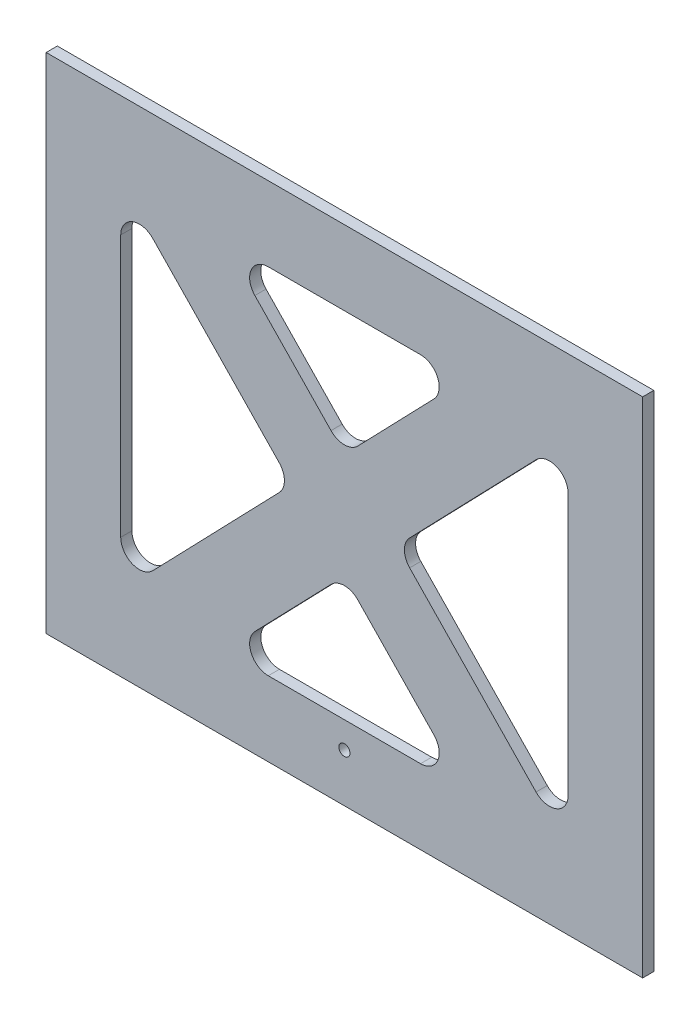
ISO-10303-21;
HEADER;
FILE_DESCRIPTION(('STEP AP214'),'2;1');
FILE_NAME('part.step','',(''),(''),'','','');
FILE_SCHEMA(('AUTOMOTIVE_DESIGN { 1 0 10303 214 1 1 1 1 }'));
ENDSEC;
DATA;
#1=APPLICATION_CONTEXT('core data for automotive mechanical design processes');
#2=APPLICATION_PROTOCOL_DEFINITION('international standard','automotive_design',2000,#1);
#3=PRODUCT_CONTEXT('',#1,'mechanical');
#4=PRODUCT('Part','Part','',(#3));
#5=PRODUCT_RELATED_PRODUCT_CATEGORY('part','',(#4));
#6=PRODUCT_DEFINITION_FORMATION('','',#4);
#7=PRODUCT_DEFINITION_CONTEXT('part definition',#1,'design');
#8=PRODUCT_DEFINITION('design','',#6,#7);
#9=PRODUCT_DEFINITION_SHAPE('','',#8);
#10=(LENGTH_UNIT() NAMED_UNIT(*) SI_UNIT(.MILLI.,.METRE.));
#11=(NAMED_UNIT(*) PLANE_ANGLE_UNIT() SI_UNIT($,.RADIAN.));
#12=(NAMED_UNIT(*) SI_UNIT($,.STERADIAN.) SOLID_ANGLE_UNIT());
#13=UNCERTAINTY_MEASURE_WITH_UNIT(LENGTH_MEASURE(1.E-05),#10,'distance_accuracy_value','');
#14=(GEOMETRIC_REPRESENTATION_CONTEXT(3) GLOBAL_UNCERTAINTY_ASSIGNED_CONTEXT((#13)) GLOBAL_UNIT_ASSIGNED_CONTEXT((#10,
#11,#12)) REPRESENTATION_CONTEXT('',''));
#15=CARTESIAN_POINT('',(0.,0.,0.));
#16=DIRECTION('',(0.,0.,1.));
#17=DIRECTION('',(1.,0.,0.));
#18=AXIS2_PLACEMENT_3D('',#15,#16,#17);
#19=CARTESIAN_POINT('',(0.,0.,154.999999999998));
#20=DIRECTION('',(0.,0.,1.));
#21=DIRECTION('',(1.,0.,0.));
#22=AXIS2_PLACEMENT_3D('',#19,#20,#21);
#23=PLANE('',#22);
#24=CARTESIAN_POINT('',(-1.74582570622306E-11,-41.6319362166387,154.999999999998));
#25=DIRECTION('',(0.,0.,1.));
#26=DIRECTION('',(1.,0.,0.));
#27=AXIS2_PLACEMENT_3D('',#24,#25,#26);
#28=CIRCLE('',#27,1.5);
#29=CARTESIAN_POINT('',(1.49999999998254,-41.6319362166387,154.999999999998));
#30=VERTEX_POINT('',#29);
#31=EDGE_CURVE('E597',#30,#30,#28,.T.);
#32=ORIENTED_EDGE('',*,*,#31,.F.);
#33=EDGE_LOOP('',(#32));
#34=FACE_BOUND('',#33,.T.);
#35=DIRECTION('',(0.,-1.,0.));
#36=VECTOR('',#35,1.);
#37=CARTESIAN_POINT('',(-80.0000000000175,80.4171451103803,154.999999999998));
#38=LINE('',#37,#36);
#39=CARTESIAN_POINT('',(-80.0000000000175,80.4171451103803,154.999999999998));
#40=VERTEX_POINT('',#39);
#41=CARTESIAN_POINT('',(-80.0000000000175,-54.5828548896206,154.999999999998));
#42=VERTEX_POINT('',#41);
#43=EDGE_CURVE('E411',#40,#42,#38,.T.);
#44=ORIENTED_EDGE('',*,*,#43,.T.);
#45=DIRECTION('',(1.,0.,0.));
#46=VECTOR('',#45,1.);
#47=CARTESIAN_POINT('',(-80.0000000000175,-54.5828548896206,154.999999999998));
#48=LINE('',#47,#46);
#49=CARTESIAN_POINT('',(79.9999999999825,-54.5828548896206,154.999999999998));
#50=VERTEX_POINT('',#49);
#51=EDGE_CURVE('E414',#42,#50,#48,.T.);
#52=ORIENTED_EDGE('',*,*,#51,.T.);
#53=DIRECTION('',(0.,1.,0.));
#54=VECTOR('',#53,1.);
#55=CARTESIAN_POINT('',(79.9999999999825,80.4171451103803,154.999999999998));
#56=LINE('',#55,#54);
#57=CARTESIAN_POINT('',(79.9999999999825,80.4171451103803,154.999999999998));
#58=VERTEX_POINT('',#57);
#59=EDGE_CURVE('E417',#50,#58,#56,.T.);
#60=ORIENTED_EDGE('',*,*,#59,.T.);
#61=DIRECTION('',(-1.,0.,0.));
#62=VECTOR('',#61,1.);
#63=CARTESIAN_POINT('',(-80.0000000000175,80.4171451103803,154.999999999998));
#64=LINE('',#63,#62);
#65=EDGE_CURVE('E419',#58,#40,#64,.T.);
#66=ORIENTED_EDGE('',*,*,#65,.T.);
#67=EDGE_LOOP('',(#44,#52,#60,#66));
#68=FACE_BOUND('',#67,.T.);
#69=DIRECTION('',(0.694544358283579,0.719449883158272,0.));
#70=VECTOR('',#69,1.);
#71=CARTESIAN_POINT('',(-17.4968341698801,9.44442331896196,154.999999999998));
#72=LINE('',#71,#70);
#73=CARTESIAN_POINT('',(-51.4027505842312,-25.6773184556925,154.999999999998));
#74=VERTEX_POINT('',#73);
#75=CARTESIAN_POINT('',(-17.4968341698801,9.44442331896196,154.999999999998));
#76=VERTEX_POINT('',#75);
#77=EDGE_CURVE('E368',#74,#76,#72,.T.);
#78=ORIENTED_EDGE('',*,*,#77,.F.);
#79=CARTESIAN_POINT('',(-55.0000000000225,-22.2045966642746,154.999999999998));
#80=DIRECTION('',(0.,0.,1.));
#81=DIRECTION('',(-1.,0.,0.));
#82=AXIS2_PLACEMENT_3D('',#79,#80,#81);
#83=CIRCLE('',#82,4.99999999999999);
#84=CARTESIAN_POINT('',(-60.0000000000225,-22.2045966642746,154.999999999998));
#85=VERTEX_POINT('',#84);
#86=EDGE_CURVE('E366',#85,#74,#83,.T.);
#87=ORIENTED_EDGE('',*,*,#86,.F.);
#88=DIRECTION('',(0.,-1.,0.));
#89=VECTOR('',#88,1.);
#90=CARTESIAN_POINT('',(-60.0000000000225,-22.2045966642746,154.999999999998));
#91=LINE('',#90,#89);
#92=CARTESIAN_POINT('',(-60.0000000000225,48.0388868850344,154.999999999998));
#93=VERTEX_POINT('',#92);
#94=EDGE_CURVE('E378',#93,#85,#91,.T.);
#95=ORIENTED_EDGE('',*,*,#94,.F.);
#96=CARTESIAN_POINT('',(-55.0000000000225,48.0388868850344,154.999999999998));
#97=DIRECTION('',(0.,0.,1.));
#98=DIRECTION('',(1.,0.,0.));
#99=AXIS2_PLACEMENT_3D('',#96,#97,#98);
#100=CIRCLE('',#99,4.99999999999999);
#101=CARTESIAN_POINT('',(-51.4027505842312,51.5116086764523,154.999999999998));
#102=VERTEX_POINT('',#101);
#103=EDGE_CURVE('E375',#102,#93,#100,.T.);
#104=ORIENTED_EDGE('',*,*,#103,.F.);
#105=DIRECTION('',(-0.694544358283579,0.719449883158272,0.));
#106=VECTOR('',#105,1.);
#107=CARTESIAN_POINT('',(-51.4027505842312,51.5116086764523,154.999999999998));
#108=LINE('',#107,#106);
#109=CARTESIAN_POINT('',(-17.4968341698801,16.3898669017978,154.999999999998));
#110=VERTEX_POINT('',#109);
#111=EDGE_CURVE('E373',#110,#102,#108,.T.);
#112=ORIENTED_EDGE('',*,*,#111,.F.);
#113=CARTESIAN_POINT('',(-21.0940835856715,12.9171451103799,154.999999999998));
#114=DIRECTION('',(0.,0.,1.));
#115=DIRECTION('',(1.,0.,0.));
#116=AXIS2_PLACEMENT_3D('',#113,#114,#115);
#117=CIRCLE('',#116,5.);
#118=EDGE_CURVE('E371',#76,#110,#117,.T.);
#119=ORIENTED_EDGE('',*,*,#118,.F.);
#120=EDGE_LOOP('',(#78,#87,#95,#104,#112,#119));
#121=FACE_BOUND('',#120,.T.);
#122=DIRECTION('',(-0.694544358283579,0.719449883158272,0.));
#123=VECTOR('',#122,1.);
#124=CARTESIAN_POINT('',(3.59724941577325,-4.95342651376468,154.999999999998));
#125=LINE('',#124,#123);
#126=CARTESIAN_POINT('',(24.0215646350307,-26.1101330982027,154.999999999998));
#127=VERTEX_POINT('',#126);
#128=CARTESIAN_POINT('',(3.59724941577325,-4.95342651376468,154.999999999998));
#129=VERTEX_POINT('',#128);
#130=EDGE_CURVE('E323',#127,#129,#125,.T.);
#131=ORIENTED_EDGE('',*,*,#130,.F.);
#132=CARTESIAN_POINT('',(20.4243152192394,-29.5828548896206,154.999999999998));
#133=DIRECTION('',(0.,0.,1.));
#134=DIRECTION('',(-1.,0.,0.));
#135=AXIS2_PLACEMENT_3D('',#132,#133,#134);
#136=CIRCLE('',#135,5.);
#137=CARTESIAN_POINT('',(20.4243152192394,-34.5828548896206,154.999999999998));
#138=VERTEX_POINT('',#137);
#139=EDGE_CURVE('E321',#138,#127,#136,.T.);
#140=ORIENTED_EDGE('',*,*,#139,.F.);
#141=DIRECTION('',(1.,0.,0.));
#142=VECTOR('',#141,1.);
#143=CARTESIAN_POINT('',(20.4243152192394,-34.5828548896206,154.999999999998));
#144=LINE('',#143,#142);
#145=CARTESIAN_POINT('',(-20.4243152192756,-34.5828548896206,154.999999999998));
#146=VERTEX_POINT('',#145);
#147=EDGE_CURVE('E333',#146,#138,#144,.T.);
#148=ORIENTED_EDGE('',*,*,#147,.F.);
#149=CARTESIAN_POINT('',(-20.4243152192756,-29.5828548896206,154.999999999998));
#150=DIRECTION('',(0.,0.,1.));
#151=DIRECTION('',(1.,0.,0.));
#152=AXIS2_PLACEMENT_3D('',#149,#150,#151);
#153=CIRCLE('',#152,5.);
#154=CARTESIAN_POINT('',(-24.0215646350669,-26.1101330982027,154.999999999998));
#155=VERTEX_POINT('',#154);
#156=EDGE_CURVE('E330',#155,#146,#153,.T.);
#157=ORIENTED_EDGE('',*,*,#156,.F.);
#158=DIRECTION('',(-0.694544358283579,-0.719449883158272,0.));
#159=VECTOR('',#158,1.);
#160=CARTESIAN_POINT('',(-24.0215646350669,-26.1101330982027,154.999999999998));
#161=LINE('',#160,#159);
#162=CARTESIAN_POINT('',(-3.59724941580946,-4.95342651376468,154.999999999998));
#163=VERTEX_POINT('',#162);
#164=EDGE_CURVE('E328',#163,#155,#161,.T.);
#165=ORIENTED_EDGE('',*,*,#164,.F.);
#166=CARTESIAN_POINT('',(-1.81005299471863E-11,-8.42614830518258,154.999999999998));
#167=DIRECTION('',(0.,0.,1.));
#168=DIRECTION('',(-1.,0.,0.));
#169=AXIS2_PLACEMENT_3D('',#166,#167,#168);
#170=CIRCLE('',#169,5.);
#171=EDGE_CURVE('E326',#129,#163,#170,.T.);
#172=ORIENTED_EDGE('',*,*,#171,.F.);
#173=EDGE_LOOP('',(#131,#140,#148,#157,#165,#172));
#174=FACE_BOUND('',#173,.T.);
#175=DIRECTION('',(0.69454435828358,-0.719449883158272,0.));
#176=VECTOR('',#175,1.);
#177=CARTESIAN_POINT('',(17.4968341698452,9.44442331896196,154.999999999998));
#178=LINE('',#177,#176);
#179=CARTESIAN_POINT('',(17.4968341698452,9.44442331896196,154.999999999998));
#180=VERTEX_POINT('',#179);
#181=CARTESIAN_POINT('',(51.4027505841949,-25.6773184556912,154.999999999998));
#182=VERTEX_POINT('',#181);
#183=EDGE_CURVE('E278',#180,#182,#178,.T.);
#184=ORIENTED_EDGE('',*,*,#183,.F.);
#185=CARTESIAN_POINT('',(21.0940835856365,12.9171451103799,154.999999999998));
#186=DIRECTION('',(0.,0.,1.));
#187=DIRECTION('',(1.,0.,0.));
#188=AXIS2_PLACEMENT_3D('',#185,#186,#187);
#189=CIRCLE('',#188,5.);
#190=CARTESIAN_POINT('',(17.4968341698452,16.3898669017977,154.999999999998));
#191=VERTEX_POINT('',#190);
#192=EDGE_CURVE('E276',#191,#180,#189,.T.);
#193=ORIENTED_EDGE('',*,*,#192,.F.);
#194=DIRECTION('',(-0.694544358283579,-0.719449883158272,0.));
#195=VECTOR('',#194,1.);
#196=CARTESIAN_POINT('',(51.402750584195,51.5116086764509,154.999999999998));
#197=LINE('',#196,#195);
#198=CARTESIAN_POINT('',(51.402750584195,51.5116086764509,154.999999999998));
#199=VERTEX_POINT('',#198);
#200=EDGE_CURVE('E288',#199,#191,#197,.T.);
#201=ORIENTED_EDGE('',*,*,#200,.F.);
#202=CARTESIAN_POINT('',(54.9999999999863,48.038886885033,154.999999999998));
#203=DIRECTION('',(0.,0.,1.));
#204=DIRECTION('',(1.,0.,0.));
#205=AXIS2_PLACEMENT_3D('',#202,#203,#204);
#206=CIRCLE('',#205,5.);
#207=CARTESIAN_POINT('',(59.9999999999863,48.038886885033,154.999999999998));
#208=VERTEX_POINT('',#207);
#209=EDGE_CURVE('E285',#208,#199,#206,.T.);
#210=ORIENTED_EDGE('',*,*,#209,.F.);
#211=DIRECTION('',(0.,1.,0.));
#212=VECTOR('',#211,1.);
#213=CARTESIAN_POINT('',(59.9999999999863,-22.2045966642733,154.999999999998));
#214=LINE('',#213,#212);
#215=CARTESIAN_POINT('',(59.9999999999863,-22.2045966642733,154.999999999998));
#216=VERTEX_POINT('',#215);
#217=EDGE_CURVE('E283',#216,#208,#214,.T.);
#218=ORIENTED_EDGE('',*,*,#217,.F.);
#219=CARTESIAN_POINT('',(54.9999999999863,-22.2045966642733,154.999999999998));
#220=DIRECTION('',(0.,0.,1.));
#221=DIRECTION('',(1.,0.,0.));
#222=AXIS2_PLACEMENT_3D('',#219,#220,#221);
#223=CIRCLE('',#222,5.00000000000001);
#224=EDGE_CURVE('E281',#182,#216,#223,.T.);
#225=ORIENTED_EDGE('',*,*,#224,.F.);
#226=EDGE_LOOP('',(#184,#193,#201,#210,#218,#225));
#227=FACE_BOUND('',#226,.T.);
#228=DIRECTION('',(0.694544358283579,-0.719449883158272,0.));
#229=VECTOR('',#228,1.);
#230=CARTESIAN_POINT('',(-24.0215646350669,51.9444233189624,154.999999999998));
#231=LINE('',#230,#229);
#232=CARTESIAN_POINT('',(-24.0215646350669,51.9444233189624,154.999999999998));
#233=VERTEX_POINT('',#232);
#234=CARTESIAN_POINT('',(-3.59724941580946,30.7877167345244,154.999999999998));
#235=VERTEX_POINT('',#234);
#236=EDGE_CURVE('E232',#233,#235,#231,.T.);
#237=ORIENTED_EDGE('',*,*,#236,.F.);
#238=CARTESIAN_POINT('',(-20.4243152192756,55.4171451103803,154.999999999998));
#239=DIRECTION('',(0.,0.,1.));
#240=DIRECTION('',(-1.,0.,0.));
#241=AXIS2_PLACEMENT_3D('',#238,#239,#240);
#242=CIRCLE('',#241,5.);
#243=CARTESIAN_POINT('',(-20.4243152192756,60.4171451103803,154.999999999998));
#244=VERTEX_POINT('',#243);
#245=EDGE_CURVE('E224',#244,#233,#242,.T.);
#246=ORIENTED_EDGE('',*,*,#245,.F.);
#247=DIRECTION('',(-1.,0.,0.));
#248=VECTOR('',#247,1.);
#249=CARTESIAN_POINT('',(20.4243152192394,60.4171451103803,154.999999999998));
#250=LINE('',#249,#248);
#251=CARTESIAN_POINT('',(20.4243152192394,60.4171451103803,154.999999999998));
#252=VERTEX_POINT('',#251);
#253=EDGE_CURVE('E254',#252,#244,#250,.T.);
#254=ORIENTED_EDGE('',*,*,#253,.F.);
#255=CARTESIAN_POINT('',(20.4243152192394,55.4171451103803,154.999999999998));
#256=DIRECTION('',(0.,0.,1.));
#257=DIRECTION('',(1.,0.,0.));
#258=AXIS2_PLACEMENT_3D('',#255,#256,#257);
#259=CIRCLE('',#258,5.);
#260=CARTESIAN_POINT('',(24.0215646350307,51.9444233189624,154.999999999998));
#261=VERTEX_POINT('',#260);
#262=EDGE_CURVE('E252',#261,#252,#259,.T.);
#263=ORIENTED_EDGE('',*,*,#262,.F.);
#264=DIRECTION('',(0.69454435828358,0.719449883158272,0.));
#265=VECTOR('',#264,1.);
#266=CARTESIAN_POINT('',(3.59724941577325,30.7877167345244,154.999999999998));
#267=LINE('',#266,#265);
#268=CARTESIAN_POINT('',(3.59724941577326,30.7877167345244,154.999999999998));
#269=VERTEX_POINT('',#268);
#270=EDGE_CURVE('E247',#269,#261,#267,.T.);
#271=ORIENTED_EDGE('',*,*,#270,.F.);
#272=CARTESIAN_POINT('',(-1.81005299471863E-11,34.2604385259423,154.999999999998));
#273=DIRECTION('',(0.,0.,1.));
#274=DIRECTION('',(-1.,0.,0.));
#275=AXIS2_PLACEMENT_3D('',#272,#273,#274);
#276=CIRCLE('',#275,5.);
#277=EDGE_CURVE('E245',#235,#269,#276,.T.);
#278=ORIENTED_EDGE('',*,*,#277,.F.);
#279=EDGE_LOOP('',(#237,#246,#254,#263,#271,#278));
#280=FACE_BOUND('',#279,.T.);
#281=ADVANCED_FACE('F38',(#34,#68,#121,#174,#227,#280),#23,.T.);
#282=CARTESIAN_POINT('',(0.,0.,151.999999999998));
#283=DIRECTION('',(0.,0.,1.));
#284=DIRECTION('',(1.,0.,0.));
#285=AXIS2_PLACEMENT_3D('',#282,#283,#284);
#286=PLANE('',#285);
#287=CARTESIAN_POINT('',(-1.74582570622306E-11,-41.6319362166387,151.999999999998));
#288=DIRECTION('',(0.,0.,1.));
#289=DIRECTION('',(1.,0.,0.));
#290=AXIS2_PLACEMENT_3D('',#287,#288,#289);
#291=CIRCLE('',#290,1.5);
#292=CARTESIAN_POINT('',(1.49999999998254,-41.6319362166387,151.999999999998));
#293=VERTEX_POINT('',#292);
#294=EDGE_CURVE('E42',#293,#293,#291,.T.);
#295=ORIENTED_EDGE('',*,*,#294,.T.);
#296=EDGE_LOOP('',(#295));
#297=FACE_BOUND('',#296,.T.);
#298=CARTESIAN_POINT('',(21.0940835856365,12.9171451103799,151.999999999998));
#299=DIRECTION('',(0.,0.,1.));
#300=DIRECTION('',(1.,0.,0.));
#301=AXIS2_PLACEMENT_3D('',#298,#299,#300);
#302=CIRCLE('',#301,5.);
#303=CARTESIAN_POINT('',(17.4968341698452,16.3898669017977,151.999999999998));
#304=VERTEX_POINT('',#303);
#305=CARTESIAN_POINT('',(17.4968341698452,9.44442331896196,151.999999999998));
#306=VERTEX_POINT('',#305);
#307=EDGE_CURVE('E240',#304,#306,#302,.T.);
#308=ORIENTED_EDGE('',*,*,#307,.T.);
#309=DIRECTION('',(0.69454435828358,-0.719449883158272,0.));
#310=VECTOR('',#309,1.);
#311=CARTESIAN_POINT('',(17.4968341698452,9.44442331896196,151.999999999998));
#312=LINE('',#311,#310);
#313=CARTESIAN_POINT('',(51.4027505841949,-25.6773184556912,151.999999999998));
#314=VERTEX_POINT('',#313);
#315=EDGE_CURVE('E293',#306,#314,#312,.T.);
#316=ORIENTED_EDGE('',*,*,#315,.T.);
#317=CARTESIAN_POINT('',(54.9999999999863,-22.2045966642733,151.999999999998));
#318=DIRECTION('',(0.,0.,1.));
#319=DIRECTION('',(1.,0.,0.));
#320=AXIS2_PLACEMENT_3D('',#317,#318,#319);
#321=CIRCLE('',#320,5.00000000000001);
#322=CARTESIAN_POINT('',(59.9999999999863,-22.2045966642733,151.999999999998));
#323=VERTEX_POINT('',#322);
#324=EDGE_CURVE('E296',#314,#323,#321,.T.);
#325=ORIENTED_EDGE('',*,*,#324,.T.);
#326=DIRECTION('',(0.,1.,0.));
#327=VECTOR('',#326,1.);
#328=CARTESIAN_POINT('',(59.9999999999863,-22.2045966642733,151.999999999998));
#329=LINE('',#328,#327);
#330=CARTESIAN_POINT('',(59.9999999999863,48.038886885033,151.999999999998));
#331=VERTEX_POINT('',#330);
#332=EDGE_CURVE('E299',#323,#331,#329,.T.);
#333=ORIENTED_EDGE('',*,*,#332,.T.);
#334=CARTESIAN_POINT('',(54.9999999999863,48.038886885033,151.999999999998));
#335=DIRECTION('',(0.,0.,1.));
#336=DIRECTION('',(1.,0.,0.));
#337=AXIS2_PLACEMENT_3D('',#334,#335,#336);
#338=CIRCLE('',#337,5.);
#339=CARTESIAN_POINT('',(51.402750584195,51.5116086764509,151.999999999998));
#340=VERTEX_POINT('',#339);
#341=EDGE_CURVE('E302',#331,#340,#338,.T.);
#342=ORIENTED_EDGE('',*,*,#341,.T.);
#343=DIRECTION('',(-0.694544358283579,-0.719449883158272,0.));
#344=VECTOR('',#343,1.);
#345=CARTESIAN_POINT('',(51.402750584195,51.5116086764509,151.999999999998));
#346=LINE('',#345,#344);
#347=EDGE_CURVE('E279',#340,#304,#346,.T.);
#348=ORIENTED_EDGE('',*,*,#347,.T.);
#349=EDGE_LOOP('',(#308,#316,#325,#333,#342,#348));
#350=FACE_BOUND('',#349,.T.);
#351=CARTESIAN_POINT('',(-55.0000000000225,-22.2045966642746,151.999999999998));
#352=DIRECTION('',(0.,0.,1.));
#353=DIRECTION('',(-1.,0.,0.));
#354=AXIS2_PLACEMENT_3D('',#351,#352,#353);
#355=CIRCLE('',#354,4.99999999999999);
#356=CARTESIAN_POINT('',(-60.0000000000225,-22.2045966642746,151.999999999998));
#357=VERTEX_POINT('',#356);
#358=CARTESIAN_POINT('',(-51.4027505842312,-25.6773184556925,151.999999999998));
#359=VERTEX_POINT('',#358);
#360=EDGE_CURVE('E365',#357,#359,#355,.T.);
#361=ORIENTED_EDGE('',*,*,#360,.T.);
#362=DIRECTION('',(0.694544358283579,0.719449883158272,0.));
#363=VECTOR('',#362,1.);
#364=CARTESIAN_POINT('',(-17.4968341698801,9.44442331896196,151.999999999998));
#365=LINE('',#364,#363);
#366=CARTESIAN_POINT('',(-17.4968341698801,9.44442331896196,151.999999999998));
#367=VERTEX_POINT('',#366);
#368=EDGE_CURVE('E383',#359,#367,#365,.T.);
#369=ORIENTED_EDGE('',*,*,#368,.T.);
#370=CARTESIAN_POINT('',(-21.0940835856715,12.9171451103799,151.999999999998));
#371=DIRECTION('',(0.,0.,1.));
#372=DIRECTION('',(1.,0.,0.));
#373=AXIS2_PLACEMENT_3D('',#370,#371,#372);
#374=CIRCLE('',#373,5.);
#375=CARTESIAN_POINT('',(-17.4968341698801,16.3898669017978,151.999999999998));
#376=VERTEX_POINT('',#375);
#377=EDGE_CURVE('E386',#367,#376,#374,.T.);
#378=ORIENTED_EDGE('',*,*,#377,.T.);
#379=DIRECTION('',(-0.694544358283579,0.719449883158272,0.));
#380=VECTOR('',#379,1.);
#381=CARTESIAN_POINT('',(-51.4027505842312,51.5116086764523,151.999999999998));
#382=LINE('',#381,#380);
#383=CARTESIAN_POINT('',(-51.4027505842312,51.5116086764523,151.999999999998));
#384=VERTEX_POINT('',#383);
#385=EDGE_CURVE('E389',#376,#384,#382,.T.);
#386=ORIENTED_EDGE('',*,*,#385,.T.);
#387=CARTESIAN_POINT('',(-55.0000000000225,48.0388868850344,151.999999999998));
#388=DIRECTION('',(0.,0.,1.));
#389=DIRECTION('',(1.,0.,0.));
#390=AXIS2_PLACEMENT_3D('',#387,#388,#389);
#391=CIRCLE('',#390,4.99999999999999);
#392=CARTESIAN_POINT('',(-60.0000000000225,48.0388868850344,151.999999999998));
#393=VERTEX_POINT('',#392);
#394=EDGE_CURVE('E392',#384,#393,#391,.T.);
#395=ORIENTED_EDGE('',*,*,#394,.T.);
#396=DIRECTION('',(0.,-1.,0.));
#397=VECTOR('',#396,1.);
#398=CARTESIAN_POINT('',(-60.0000000000225,-22.2045966642746,151.999999999998));
#399=LINE('',#398,#397);
#400=EDGE_CURVE('E369',#393,#357,#399,.T.);
#401=ORIENTED_EDGE('',*,*,#400,.T.);
#402=EDGE_LOOP('',(#361,#369,#378,#386,#395,#401));
#403=FACE_BOUND('',#402,.T.);
#404=DIRECTION('',(0.,-1.,0.));
#405=VECTOR('',#404,1.);
#406=CARTESIAN_POINT('',(-80.0000000000175,80.4171451103803,151.999999999998));
#407=LINE('',#406,#405);
#408=CARTESIAN_POINT('',(-80.0000000000175,80.4171451103803,151.999999999998));
#409=VERTEX_POINT('',#408);
#410=CARTESIAN_POINT('',(-80.0000000000175,-54.5828548896206,151.999999999998));
#411=VERTEX_POINT('',#410);
#412=EDGE_CURVE('E410',#409,#411,#407,.T.);
#413=ORIENTED_EDGE('',*,*,#412,.F.);
#414=DIRECTION('',(-1.,0.,0.));
#415=VECTOR('',#414,1.);
#416=CARTESIAN_POINT('',(-80.0000000000175,80.4171451103803,151.999999999998));
#417=LINE('',#416,#415);
#418=CARTESIAN_POINT('',(79.9999999999825,80.4171451103803,151.999999999998));
#419=VERTEX_POINT('',#418);
#420=EDGE_CURVE('E415',#419,#409,#417,.T.);
#421=ORIENTED_EDGE('',*,*,#420,.F.);
#422=DIRECTION('',(0.,1.,0.));
#423=VECTOR('',#422,1.);
#424=CARTESIAN_POINT('',(79.9999999999825,80.4171451103803,151.999999999998));
#425=LINE('',#424,#423);
#426=CARTESIAN_POINT('',(79.9999999999825,-54.5828548896206,151.999999999998));
#427=VERTEX_POINT('',#426);
#428=EDGE_CURVE('E426',#427,#419,#425,.T.);
#429=ORIENTED_EDGE('',*,*,#428,.F.);
#430=DIRECTION('',(1.,0.,0.));
#431=VECTOR('',#430,1.);
#432=CARTESIAN_POINT('',(-80.0000000000175,-54.5828548896206,151.999999999998));
#433=LINE('',#432,#431);
#434=EDGE_CURVE('E424',#411,#427,#433,.T.);
#435=ORIENTED_EDGE('',*,*,#434,.F.);
#436=EDGE_LOOP('',(#413,#421,#429,#435));
#437=FACE_BOUND('',#436,.T.);
#438=CARTESIAN_POINT('',(20.4243152192394,-29.5828548896206,151.999999999998));
#439=DIRECTION('',(0.,0.,1.));
#440=DIRECTION('',(-1.,0.,0.));
#441=AXIS2_PLACEMENT_3D('',#438,#439,#440);
#442=CIRCLE('',#441,5.);
#443=CARTESIAN_POINT('',(20.4243152192394,-34.5828548896206,151.999999999998));
#444=VERTEX_POINT('',#443);
#445=CARTESIAN_POINT('',(24.0215646350307,-26.1101330982027,151.999999999998));
#446=VERTEX_POINT('',#445);
#447=EDGE_CURVE('E320',#444,#446,#442,.T.);
#448=ORIENTED_EDGE('',*,*,#447,.T.);
#449=DIRECTION('',(-0.694544358283579,0.719449883158272,0.));
#450=VECTOR('',#449,1.);
#451=CARTESIAN_POINT('',(3.59724941577325,-4.95342651376468,151.999999999998));
#452=LINE('',#451,#450);
#453=CARTESIAN_POINT('',(3.59724941577325,-4.95342651376468,151.999999999998));
#454=VERTEX_POINT('',#453);
#455=EDGE_CURVE('E338',#446,#454,#452,.T.);
#456=ORIENTED_EDGE('',*,*,#455,.T.);
#457=CARTESIAN_POINT('',(-1.81005299471863E-11,-8.42614830518258,151.999999999998));
#458=DIRECTION('',(0.,0.,1.));
#459=DIRECTION('',(-1.,0.,0.));
#460=AXIS2_PLACEMENT_3D('',#457,#458,#459);
#461=CIRCLE('',#460,5.);
#462=CARTESIAN_POINT('',(-3.59724941580946,-4.95342651376468,151.999999999998));
#463=VERTEX_POINT('',#462);
#464=EDGE_CURVE('E341',#454,#463,#461,.T.);
#465=ORIENTED_EDGE('',*,*,#464,.T.);
#466=DIRECTION('',(-0.694544358283579,-0.719449883158272,0.));
#467=VECTOR('',#466,1.);
#468=CARTESIAN_POINT('',(-24.0215646350669,-26.1101330982027,151.999999999998));
#469=LINE('',#468,#467);
#470=CARTESIAN_POINT('',(-24.0215646350669,-26.1101330982027,151.999999999998));
#471=VERTEX_POINT('',#470);
#472=EDGE_CURVE('E344',#463,#471,#469,.T.);
#473=ORIENTED_EDGE('',*,*,#472,.T.);
#474=CARTESIAN_POINT('',(-20.4243152192756,-29.5828548896206,151.999999999998));
#475=DIRECTION('',(0.,0.,1.));
#476=DIRECTION('',(1.,0.,0.));
#477=AXIS2_PLACEMENT_3D('',#474,#475,#476);
#478=CIRCLE('',#477,5.);
#479=CARTESIAN_POINT('',(-20.4243152192756,-34.5828548896206,151.999999999998));
#480=VERTEX_POINT('',#479);
#481=EDGE_CURVE('E347',#471,#480,#478,.T.);
#482=ORIENTED_EDGE('',*,*,#481,.T.);
#483=DIRECTION('',(1.,0.,0.));
#484=VECTOR('',#483,1.);
#485=CARTESIAN_POINT('',(20.4243152192394,-34.5828548896206,151.999999999998));
#486=LINE('',#485,#484);
#487=EDGE_CURVE('E324',#480,#444,#486,.T.);
#488=ORIENTED_EDGE('',*,*,#487,.T.);
#489=EDGE_LOOP('',(#448,#456,#465,#473,#482,#488));
#490=FACE_BOUND('',#489,.T.);
#491=CARTESIAN_POINT('',(-20.4243152192756,55.4171451103803,151.999999999998));
#492=DIRECTION('',(0.,0.,1.));
#493=DIRECTION('',(-1.,0.,0.));
#494=AXIS2_PLACEMENT_3D('',#491,#492,#493);
#495=CIRCLE('',#494,5.);
#496=CARTESIAN_POINT('',(-20.4243152192756,60.4171451103803,151.999999999998));
#497=VERTEX_POINT('',#496);
#498=CARTESIAN_POINT('',(-24.0215646350669,51.9444233189624,151.999999999998));
#499=VERTEX_POINT('',#498);
#500=EDGE_CURVE('E62',#497,#499,#495,.T.);
#501=ORIENTED_EDGE('',*,*,#500,.T.);
#502=DIRECTION('',(0.694544358283579,-0.719449883158272,0.));
#503=VECTOR('',#502,1.);
#504=CARTESIAN_POINT('',(-24.0215646350669,51.9444233189624,151.999999999998));
#505=LINE('',#504,#503);
#506=CARTESIAN_POINT('',(-3.59724941580946,30.7877167345244,151.999999999998));
#507=VERTEX_POINT('',#506);
#508=EDGE_CURVE('E239',#499,#507,#505,.T.);
#509=ORIENTED_EDGE('',*,*,#508,.T.);
#510=CARTESIAN_POINT('',(-1.81005299471863E-11,34.2604385259423,151.999999999998));
#511=DIRECTION('',(0.,0.,1.));
#512=DIRECTION('',(-1.,0.,0.));
#513=AXIS2_PLACEMENT_3D('',#510,#511,#512);
#514=CIRCLE('',#513,5.);
#515=CARTESIAN_POINT('',(3.59724941577326,30.7877167345244,151.999999999998));
#516=VERTEX_POINT('',#515);
#517=EDGE_CURVE('E258',#507,#516,#514,.T.);
#518=ORIENTED_EDGE('',*,*,#517,.T.);
#519=DIRECTION('',(0.69454435828358,0.719449883158272,0.));
#520=VECTOR('',#519,1.);
#521=CARTESIAN_POINT('',(3.59724941577325,30.7877167345244,151.999999999998));
#522=LINE('',#521,#520);
#523=CARTESIAN_POINT('',(24.0215646350307,51.9444233189624,151.999999999998));
#524=VERTEX_POINT('',#523);
#525=EDGE_CURVE('E261',#516,#524,#522,.T.);
#526=ORIENTED_EDGE('',*,*,#525,.T.);
#527=CARTESIAN_POINT('',(20.4243152192394,55.4171451103803,151.999999999998));
#528=DIRECTION('',(0.,0.,1.));
#529=DIRECTION('',(1.,0.,0.));
#530=AXIS2_PLACEMENT_3D('',#527,#528,#529);
#531=CIRCLE('',#530,5.);
#532=CARTESIAN_POINT('',(20.4243152192394,60.4171451103803,151.999999999998));
#533=VERTEX_POINT('',#532);
#534=EDGE_CURVE('E264',#524,#533,#531,.T.);
#535=ORIENTED_EDGE('',*,*,#534,.T.);
#536=DIRECTION('',(-1.,0.,0.));
#537=VECTOR('',#536,1.);
#538=CARTESIAN_POINT('',(20.4243152192394,60.4171451103803,151.999999999998));
#539=LINE('',#538,#537);
#540=EDGE_CURVE('E233',#533,#497,#539,.T.);
#541=ORIENTED_EDGE('',*,*,#540,.T.);
#542=EDGE_LOOP('',(#501,#509,#518,#526,#535,#541));
#543=FACE_BOUND('',#542,.T.);
#544=ADVANCED_FACE('F445',(#297,#350,#403,#437,#490,#543),#286,.F.);
#545=CARTESIAN_POINT('',(-80.0000000000175,80.4171451103803,154.999999999998));
#546=DIRECTION('',(1.,0.,0.));
#547=DIRECTION('',(0.,0.,-1.));
#548=AXIS2_PLACEMENT_3D('',#545,#546,#547);
#549=PLANE('',#548);
#550=ORIENTED_EDGE('',*,*,#412,.T.);
#551=DIRECTION('',(0.,0.,-1.));
#552=VECTOR('',#551,1.);
#553=CARTESIAN_POINT('',(-80.0000000000175,-54.5828548896206,154.999999999998));
#554=LINE('',#553,#552);
#555=EDGE_CURVE('E11',#42,#411,#554,.T.);
#556=ORIENTED_EDGE('',*,*,#555,.F.);
#557=ORIENTED_EDGE('',*,*,#43,.F.);
#558=DIRECTION('',(0.,0.,-1.));
#559=VECTOR('',#558,1.);
#560=CARTESIAN_POINT('',(-80.0000000000175,80.4171451103803,154.999999999998));
#561=LINE('',#560,#559);
#562=EDGE_CURVE('E421',#40,#409,#561,.T.);
#563=ORIENTED_EDGE('',*,*,#562,.T.);
#564=EDGE_LOOP('',(#550,#556,#557,#563));
#565=FACE_BOUND('',#564,.T.);
#566=ADVANCED_FACE('F40',(#565),#549,.F.);
#567=CARTESIAN_POINT('',(-80.0000000000175,-54.5828548896206,154.999999999998));
#568=DIRECTION('',(0.,1.,0.));
#569=DIRECTION('',(-1.,0.,0.));
#570=AXIS2_PLACEMENT_3D('',#567,#568,#569);
#571=PLANE('',#570);
#572=ORIENTED_EDGE('',*,*,#434,.T.);
#573=DIRECTION('',(0.,0.,-1.));
#574=VECTOR('',#573,1.);
#575=CARTESIAN_POINT('',(79.9999999999825,-54.5828548896206,154.999999999998));
#576=LINE('',#575,#574);
#577=EDGE_CURVE('E47',#50,#427,#576,.T.);
#578=ORIENTED_EDGE('',*,*,#577,.F.);
#579=ORIENTED_EDGE('',*,*,#51,.F.);
#580=ORIENTED_EDGE('',*,*,#555,.T.);
#581=EDGE_LOOP('',(#572,#578,#579,#580));
#582=FACE_BOUND('',#581,.T.);
#583=ADVANCED_FACE('F456',(#582),#571,.F.);
#584=CARTESIAN_POINT('',(79.9999999999825,80.4171451103803,154.999999999998));
#585=DIRECTION('',(-1.,0.,0.));
#586=DIRECTION('',(0.,0.,1.));
#587=AXIS2_PLACEMENT_3D('',#584,#585,#586);
#588=PLANE('',#587);
#589=ORIENTED_EDGE('',*,*,#428,.T.);
#590=DIRECTION('',(0.,0.,-1.));
#591=VECTOR('',#590,1.);
#592=CARTESIAN_POINT('',(79.9999999999825,80.4171451103803,154.999999999998));
#593=LINE('',#592,#591);
#594=EDGE_CURVE('E431',#58,#419,#593,.T.);
#595=ORIENTED_EDGE('',*,*,#594,.F.);
#596=ORIENTED_EDGE('',*,*,#59,.F.);
#597=ORIENTED_EDGE('',*,*,#577,.T.);
#598=EDGE_LOOP('',(#589,#595,#596,#597));
#599=FACE_BOUND('',#598,.T.);
#600=ADVANCED_FACE('F439',(#599),#588,.F.);
#601=CARTESIAN_POINT('',(-80.0000000000175,80.4171451103803,154.999999999998));
#602=DIRECTION('',(0.,-1.,0.));
#603=DIRECTION('',(0.,0.,-1.));
#604=AXIS2_PLACEMENT_3D('',#601,#602,#603);
#605=PLANE('',#604);
#606=ORIENTED_EDGE('',*,*,#420,.T.);
#607=ORIENTED_EDGE('',*,*,#562,.F.);
#608=ORIENTED_EDGE('',*,*,#65,.F.);
#609=ORIENTED_EDGE('',*,*,#594,.T.);
#610=EDGE_LOOP('',(#606,#607,#608,#609));
#611=FACE_BOUND('',#610,.T.);
#612=ADVANCED_FACE('F449',(#611),#605,.F.);
#613=CARTESIAN_POINT('',(-55.0000000000225,-22.2045966642746,154.999999999998));
#614=DIRECTION('',(0.,0.,-1.));
#615=DIRECTION('',(-1.,0.,0.));
#616=AXIS2_PLACEMENT_3D('',#613,#614,#615);
#617=CYLINDRICAL_SURFACE('',#616,4.99999999999999);
#618=ORIENTED_EDGE('',*,*,#360,.F.);
#619=DIRECTION('',(0.,0.,-1.));
#620=VECTOR('',#619,1.);
#621=CARTESIAN_POINT('',(-60.0000000000225,-22.2045966642746,154.999999999998));
#622=LINE('',#621,#620);
#623=EDGE_CURVE('E380',#85,#357,#622,.T.);
#624=ORIENTED_EDGE('',*,*,#623,.F.);
#625=ORIENTED_EDGE('',*,*,#86,.T.);
#626=DIRECTION('',(0.,0.,-1.));
#627=VECTOR('',#626,1.);
#628=CARTESIAN_POINT('',(-51.4027505842312,-25.6773184556925,154.999999999998));
#629=LINE('',#628,#627);
#630=EDGE_CURVE('E407',#74,#359,#629,.T.);
#631=ORIENTED_EDGE('',*,*,#630,.T.);
#632=EDGE_LOOP('',(#618,#624,#625,#631));
#633=FACE_BOUND('',#632,.T.);
#634=ADVANCED_FACE('F474',(#633),#617,.F.);
#635=CARTESIAN_POINT('',(-17.4968341698801,9.44442331896196,154.999999999998));
#636=DIRECTION('',(-0.719449883158272,0.694544358283579,0.));
#637=DIRECTION('',(-0.694544358283579,-0.719449883158272,0.));
#638=AXIS2_PLACEMENT_3D('',#635,#636,#637);
#639=PLANE('',#638);
#640=ORIENTED_EDGE('',*,*,#368,.F.);
#641=ORIENTED_EDGE('',*,*,#630,.F.);
#642=ORIENTED_EDGE('',*,*,#77,.T.);
#643=DIRECTION('',(0.,0.,-1.));
#644=VECTOR('',#643,1.);
#645=CARTESIAN_POINT('',(-17.4968341698801,9.44442331896196,154.999999999998));
#646=LINE('',#645,#644);
#647=EDGE_CURVE('E405',#76,#367,#646,.T.);
#648=ORIENTED_EDGE('',*,*,#647,.T.);
#649=EDGE_LOOP('',(#640,#641,#642,#648));
#650=FACE_BOUND('',#649,.T.);
#651=ADVANCED_FACE('F481',(#650),#639,.T.);
#652=CARTESIAN_POINT('',(-21.0940835856715,12.9171451103799,154.999999999998));
#653=DIRECTION('',(0.,0.,-1.));
#654=DIRECTION('',(-1.,0.,0.));
#655=AXIS2_PLACEMENT_3D('',#652,#653,#654);
#656=CYLINDRICAL_SURFACE('',#655,5.);
#657=ORIENTED_EDGE('',*,*,#377,.F.);
#658=ORIENTED_EDGE('',*,*,#647,.F.);
#659=ORIENTED_EDGE('',*,*,#118,.T.);
#660=DIRECTION('',(0.,0.,-1.));
#661=VECTOR('',#660,1.);
#662=CARTESIAN_POINT('',(-17.4968341698801,16.3898669017978,154.999999999998));
#663=LINE('',#662,#661);
#664=EDGE_CURVE('E403',#110,#376,#663,.T.);
#665=ORIENTED_EDGE('',*,*,#664,.T.);
#666=EDGE_LOOP('',(#657,#658,#659,#665));
#667=FACE_BOUND('',#666,.T.);
#668=ADVANCED_FACE('F486',(#667),#656,.F.);
#669=CARTESIAN_POINT('',(-51.4027505842312,51.5116086764523,154.999999999998));
#670=DIRECTION('',(-0.719449883158272,-0.69454435828358,0.));
#671=DIRECTION('',(0.69454435828358,-0.719449883158272,0.));
#672=AXIS2_PLACEMENT_3D('',#669,#670,#671);
#673=PLANE('',#672);
#674=ORIENTED_EDGE('',*,*,#385,.F.);
#675=ORIENTED_EDGE('',*,*,#664,.F.);
#676=ORIENTED_EDGE('',*,*,#111,.T.);
#677=DIRECTION('',(0.,0.,-1.));
#678=VECTOR('',#677,1.);
#679=CARTESIAN_POINT('',(-51.4027505842312,51.5116086764523,154.999999999998));
#680=LINE('',#679,#678);
#681=EDGE_CURVE('E401',#102,#384,#680,.T.);
#682=ORIENTED_EDGE('',*,*,#681,.T.);
#683=EDGE_LOOP('',(#674,#675,#676,#682));
#684=FACE_BOUND('',#683,.T.);
#685=ADVANCED_FACE('F511',(#684),#673,.T.);
#686=CARTESIAN_POINT('',(-55.0000000000225,48.0388868850344,154.999999999998));
#687=DIRECTION('',(0.,0.,-1.));
#688=DIRECTION('',(-1.,0.,0.));
#689=AXIS2_PLACEMENT_3D('',#686,#687,#688);
#690=CYLINDRICAL_SURFACE('',#689,4.99999999999999);
#691=ORIENTED_EDGE('',*,*,#394,.F.);
#692=ORIENTED_EDGE('',*,*,#681,.F.);
#693=ORIENTED_EDGE('',*,*,#103,.T.);
#694=DIRECTION('',(0.,0.,-1.));
#695=VECTOR('',#694,1.);
#696=CARTESIAN_POINT('',(-60.0000000000225,48.0388868850344,154.999999999998));
#697=LINE('',#696,#695);
#698=EDGE_CURVE('E399',#93,#393,#697,.T.);
#699=ORIENTED_EDGE('',*,*,#698,.T.);
#700=EDGE_LOOP('',(#691,#692,#693,#699));
#701=FACE_BOUND('',#700,.T.);
#702=ADVANCED_FACE('F500',(#701),#690,.F.);
#703=CARTESIAN_POINT('',(-60.0000000000225,-22.2045966642746,154.999999999998));
#704=DIRECTION('',(1.,0.,0.));
#705=DIRECTION('',(0.,0.,-1.));
#706=AXIS2_PLACEMENT_3D('',#703,#704,#705);
#707=PLANE('',#706);
#708=ORIENTED_EDGE('',*,*,#400,.F.);
#709=ORIENTED_EDGE('',*,*,#698,.F.);
#710=ORIENTED_EDGE('',*,*,#94,.T.);
#711=ORIENTED_EDGE('',*,*,#623,.T.);
#712=EDGE_LOOP('',(#708,#709,#710,#711));
#713=FACE_BOUND('',#712,.T.);
#714=ADVANCED_FACE('F494',(#713),#707,.T.);
#715=CARTESIAN_POINT('',(20.4243152192394,-29.5828548896206,154.999999999998));
#716=DIRECTION('',(0.,0.,-1.));
#717=DIRECTION('',(-1.,0.,0.));
#718=AXIS2_PLACEMENT_3D('',#715,#716,#717);
#719=CYLINDRICAL_SURFACE('',#718,5.);
#720=ORIENTED_EDGE('',*,*,#447,.F.);
#721=DIRECTION('',(0.,0.,-1.));
#722=VECTOR('',#721,1.);
#723=CARTESIAN_POINT('',(20.4243152192394,-34.5828548896206,154.999999999998));
#724=LINE('',#723,#722);
#725=EDGE_CURVE('E335',#138,#444,#724,.T.);
#726=ORIENTED_EDGE('',*,*,#725,.F.);
#727=ORIENTED_EDGE('',*,*,#139,.T.);
#728=DIRECTION('',(0.,0.,-1.));
#729=VECTOR('',#728,1.);
#730=CARTESIAN_POINT('',(24.0215646350307,-26.1101330982027,154.999999999998));
#731=LINE('',#730,#729);
#732=EDGE_CURVE('E362',#127,#446,#731,.T.);
#733=ORIENTED_EDGE('',*,*,#732,.T.);
#734=EDGE_LOOP('',(#720,#726,#727,#733));
#735=FACE_BOUND('',#734,.T.);
#736=ADVANCED_FACE('F523',(#735),#719,.F.);
#737=CARTESIAN_POINT('',(3.59724941577325,-4.95342651376468,154.999999999998));
#738=DIRECTION('',(-0.719449883158272,-0.694544358283579,0.));
#739=DIRECTION('',(0.694544358283579,-0.719449883158272,0.));
#740=AXIS2_PLACEMENT_3D('',#737,#738,#739);
#741=PLANE('',#740);
#742=ORIENTED_EDGE('',*,*,#455,.F.);
#743=ORIENTED_EDGE('',*,*,#732,.F.);
#744=ORIENTED_EDGE('',*,*,#130,.T.);
#745=DIRECTION('',(0.,0.,-1.));
#746=VECTOR('',#745,1.);
#747=CARTESIAN_POINT('',(3.59724941577325,-4.95342651376468,154.999999999998));
#748=LINE('',#747,#746);
#749=EDGE_CURVE('E360',#129,#454,#748,.T.);
#750=ORIENTED_EDGE('',*,*,#749,.T.);
#751=EDGE_LOOP('',(#742,#743,#744,#750));
#752=FACE_BOUND('',#751,.T.);
#753=ADVANCED_FACE('F526',(#752),#741,.T.);
#754=CARTESIAN_POINT('',(-1.81005299471863E-11,-8.42614830518258,154.999999999998));
#755=DIRECTION('',(0.,0.,-1.));
#756=DIRECTION('',(-1.,0.,0.));
#757=AXIS2_PLACEMENT_3D('',#754,#755,#756);
#758=CYLINDRICAL_SURFACE('',#757,5.);
#759=ORIENTED_EDGE('',*,*,#464,.F.);
#760=ORIENTED_EDGE('',*,*,#749,.F.);
#761=ORIENTED_EDGE('',*,*,#171,.T.);
#762=DIRECTION('',(0.,0.,-1.));
#763=VECTOR('',#762,1.);
#764=CARTESIAN_POINT('',(-3.59724941580946,-4.95342651376468,154.999999999998));
#765=LINE('',#764,#763);
#766=EDGE_CURVE('E358',#163,#463,#765,.T.);
#767=ORIENTED_EDGE('',*,*,#766,.T.);
#768=EDGE_LOOP('',(#759,#760,#761,#767));
#769=FACE_BOUND('',#768,.T.);
#770=ADVANCED_FACE('F530',(#769),#758,.F.);
#771=CARTESIAN_POINT('',(-24.0215646350669,-26.1101330982027,154.999999999998));
#772=DIRECTION('',(0.719449883158272,-0.694544358283579,0.));
#773=DIRECTION('',(0.694544358283579,0.719449883158272,0.));
#774=AXIS2_PLACEMENT_3D('',#771,#772,#773);
#775=PLANE('',#774);
#776=ORIENTED_EDGE('',*,*,#472,.F.);
#777=ORIENTED_EDGE('',*,*,#766,.F.);
#778=ORIENTED_EDGE('',*,*,#164,.T.);
#779=DIRECTION('',(0.,0.,-1.));
#780=VECTOR('',#779,1.);
#781=CARTESIAN_POINT('',(-24.0215646350669,-26.1101330982027,154.999999999998));
#782=LINE('',#781,#780);
#783=EDGE_CURVE('E356',#155,#471,#782,.T.);
#784=ORIENTED_EDGE('',*,*,#783,.T.);
#785=EDGE_LOOP('',(#776,#777,#778,#784));
#786=FACE_BOUND('',#785,.T.);
#787=ADVANCED_FACE('F534',(#786),#775,.T.);
#788=CARTESIAN_POINT('',(-20.4243152192756,-29.5828548896206,154.999999999998));
#789=DIRECTION('',(0.,0.,-1.));
#790=DIRECTION('',(-1.,0.,0.));
#791=AXIS2_PLACEMENT_3D('',#788,#789,#790);
#792=CYLINDRICAL_SURFACE('',#791,5.);
#793=ORIENTED_EDGE('',*,*,#481,.F.);
#794=ORIENTED_EDGE('',*,*,#783,.F.);
#795=ORIENTED_EDGE('',*,*,#156,.T.);
#796=DIRECTION('',(0.,0.,-1.));
#797=VECTOR('',#796,1.);
#798=CARTESIAN_POINT('',(-20.4243152192756,-34.5828548896206,154.999999999998));
#799=LINE('',#798,#797);
#800=EDGE_CURVE('E354',#146,#480,#799,.T.);
#801=ORIENTED_EDGE('',*,*,#800,.T.);
#802=EDGE_LOOP('',(#793,#794,#795,#801));
#803=FACE_BOUND('',#802,.T.);
#804=ADVANCED_FACE('F538',(#803),#792,.F.);
#805=CARTESIAN_POINT('',(20.4243152192394,-34.5828548896206,154.999999999998));
#806=DIRECTION('',(0.,1.,0.));
#807=DIRECTION('',(-1.,0.,0.));
#808=AXIS2_PLACEMENT_3D('',#805,#806,#807);
#809=PLANE('',#808);
#810=ORIENTED_EDGE('',*,*,#487,.F.);
#811=ORIENTED_EDGE('',*,*,#800,.F.);
#812=ORIENTED_EDGE('',*,*,#147,.T.);
#813=ORIENTED_EDGE('',*,*,#725,.T.);
#814=EDGE_LOOP('',(#810,#811,#812,#813));
#815=FACE_BOUND('',#814,.T.);
#816=ADVANCED_FACE('F542',(#815),#809,.T.);
#817=CARTESIAN_POINT('',(21.0940835856365,12.9171451103799,154.999999999998));
#818=DIRECTION('',(0.,0.,-1.));
#819=DIRECTION('',(-1.,0.,0.));
#820=AXIS2_PLACEMENT_3D('',#817,#818,#819);
#821=CYLINDRICAL_SURFACE('',#820,5.);
#822=ORIENTED_EDGE('',*,*,#307,.F.);
#823=DIRECTION('',(0.,0.,-1.));
#824=VECTOR('',#823,1.);
#825=CARTESIAN_POINT('',(17.4968341698452,16.3898669017977,154.999999999998));
#826=LINE('',#825,#824);
#827=EDGE_CURVE('E290',#191,#304,#826,.T.);
#828=ORIENTED_EDGE('',*,*,#827,.F.);
#829=ORIENTED_EDGE('',*,*,#192,.T.);
#830=DIRECTION('',(0.,0.,-1.));
#831=VECTOR('',#830,1.);
#832=CARTESIAN_POINT('',(17.4968341698452,9.44442331896196,154.999999999998));
#833=LINE('',#832,#831);
#834=EDGE_CURVE('E317',#180,#306,#833,.T.);
#835=ORIENTED_EDGE('',*,*,#834,.T.);
#836=EDGE_LOOP('',(#822,#828,#829,#835));
#837=FACE_BOUND('',#836,.T.);
#838=ADVANCED_FACE('F546',(#837),#821,.F.);
#839=CARTESIAN_POINT('',(17.4968341698452,9.44442331896196,154.999999999998));
#840=DIRECTION('',(0.719449883158272,0.694544358283579,0.));
#841=DIRECTION('',(-0.69454435828358,0.719449883158272,0.));
#842=AXIS2_PLACEMENT_3D('',#839,#840,#841);
#843=PLANE('',#842);
#844=ORIENTED_EDGE('',*,*,#315,.F.);
#845=ORIENTED_EDGE('',*,*,#834,.F.);
#846=ORIENTED_EDGE('',*,*,#183,.T.);
#847=DIRECTION('',(0.,0.,-1.));
#848=VECTOR('',#847,1.);
#849=CARTESIAN_POINT('',(51.4027505841949,-25.6773184556912,154.999999999998));
#850=LINE('',#849,#848);
#851=EDGE_CURVE('E315',#182,#314,#850,.T.);
#852=ORIENTED_EDGE('',*,*,#851,.T.);
#853=EDGE_LOOP('',(#844,#845,#846,#852));
#854=FACE_BOUND('',#853,.T.);
#855=ADVANCED_FACE('F550',(#854),#843,.T.);
#856=CARTESIAN_POINT('',(54.9999999999863,-22.2045966642733,154.999999999998));
#857=DIRECTION('',(0.,0.,-1.));
#858=DIRECTION('',(-1.,0.,0.));
#859=AXIS2_PLACEMENT_3D('',#856,#857,#858);
#860=CYLINDRICAL_SURFACE('',#859,5.00000000000001);
#861=ORIENTED_EDGE('',*,*,#324,.F.);
#862=ORIENTED_EDGE('',*,*,#851,.F.);
#863=ORIENTED_EDGE('',*,*,#224,.T.);
#864=DIRECTION('',(0.,0.,-1.));
#865=VECTOR('',#864,1.);
#866=CARTESIAN_POINT('',(59.9999999999863,-22.2045966642733,154.999999999998));
#867=LINE('',#866,#865);
#868=EDGE_CURVE('E313',#216,#323,#867,.T.);
#869=ORIENTED_EDGE('',*,*,#868,.T.);
#870=EDGE_LOOP('',(#861,#862,#863,#869));
#871=FACE_BOUND('',#870,.T.);
#872=ADVANCED_FACE('F554',(#871),#860,.F.);
#873=CARTESIAN_POINT('',(59.9999999999863,-22.2045966642733,154.999999999998));
#874=DIRECTION('',(-1.,0.,0.));
#875=DIRECTION('',(0.,0.,1.));
#876=AXIS2_PLACEMENT_3D('',#873,#874,#875);
#877=PLANE('',#876);
#878=ORIENTED_EDGE('',*,*,#332,.F.);
#879=ORIENTED_EDGE('',*,*,#868,.F.);
#880=ORIENTED_EDGE('',*,*,#217,.T.);
#881=DIRECTION('',(0.,0.,-1.));
#882=VECTOR('',#881,1.);
#883=CARTESIAN_POINT('',(59.9999999999863,48.038886885033,154.999999999998));
#884=LINE('',#883,#882);
#885=EDGE_CURVE('E311',#208,#331,#884,.T.);
#886=ORIENTED_EDGE('',*,*,#885,.T.);
#887=EDGE_LOOP('',(#878,#879,#880,#886));
#888=FACE_BOUND('',#887,.T.);
#889=ADVANCED_FACE('F558',(#888),#877,.T.);
#890=CARTESIAN_POINT('',(54.9999999999863,48.038886885033,154.999999999998));
#891=DIRECTION('',(0.,0.,-1.));
#892=DIRECTION('',(-1.,0.,0.));
#893=AXIS2_PLACEMENT_3D('',#890,#891,#892);
#894=CYLINDRICAL_SURFACE('',#893,5.);
#895=ORIENTED_EDGE('',*,*,#341,.F.);
#896=ORIENTED_EDGE('',*,*,#885,.F.);
#897=ORIENTED_EDGE('',*,*,#209,.T.);
#898=DIRECTION('',(0.,0.,-1.));
#899=VECTOR('',#898,1.);
#900=CARTESIAN_POINT('',(51.402750584195,51.5116086764509,154.999999999998));
#901=LINE('',#900,#899);
#902=EDGE_CURVE('E309',#199,#340,#901,.T.);
#903=ORIENTED_EDGE('',*,*,#902,.T.);
#904=EDGE_LOOP('',(#895,#896,#897,#903));
#905=FACE_BOUND('',#904,.T.);
#906=ADVANCED_FACE('F562',(#905),#894,.F.);
#907=CARTESIAN_POINT('',(51.402750584195,51.5116086764509,154.999999999998));
#908=DIRECTION('',(0.719449883158272,-0.694544358283579,0.));
#909=DIRECTION('',(0.694544358283579,0.719449883158272,0.));
#910=AXIS2_PLACEMENT_3D('',#907,#908,#909);
#911=PLANE('',#910);
#912=ORIENTED_EDGE('',*,*,#347,.F.);
#913=ORIENTED_EDGE('',*,*,#902,.F.);
#914=ORIENTED_EDGE('',*,*,#200,.T.);
#915=ORIENTED_EDGE('',*,*,#827,.T.);
#916=EDGE_LOOP('',(#912,#913,#914,#915));
#917=FACE_BOUND('',#916,.T.);
#918=ADVANCED_FACE('F566',(#917),#911,.T.);
#919=CARTESIAN_POINT('',(-20.4243152192756,55.4171451103803,154.999999999998));
#920=DIRECTION('',(0.,0.,-1.));
#921=DIRECTION('',(-1.,0.,0.));
#922=AXIS2_PLACEMENT_3D('',#919,#920,#921);
#923=CYLINDRICAL_SURFACE('',#922,5.);
#924=ORIENTED_EDGE('',*,*,#500,.F.);
#925=DIRECTION('',(0.,0.,-1.));
#926=VECTOR('',#925,1.);
#927=CARTESIAN_POINT('',(-20.4243152192756,60.4171451103803,154.999999999998));
#928=LINE('',#927,#926);
#929=EDGE_CURVE('E228',#244,#497,#928,.T.);
#930=ORIENTED_EDGE('',*,*,#929,.F.);
#931=ORIENTED_EDGE('',*,*,#245,.T.);
#932=DIRECTION('',(0.,0.,-1.));
#933=VECTOR('',#932,1.);
#934=CARTESIAN_POINT('',(-24.0215646350669,51.9444233189624,154.999999999998));
#935=LINE('',#934,#933);
#936=EDGE_CURVE('E227',#233,#499,#935,.T.);
#937=ORIENTED_EDGE('',*,*,#936,.T.);
#938=EDGE_LOOP('',(#924,#930,#931,#937));
#939=FACE_BOUND('',#938,.T.);
#940=ADVANCED_FACE('F226',(#939),#923,.F.);
#941=CARTESIAN_POINT('',(-24.0215646350669,51.9444233189624,154.999999999998));
#942=DIRECTION('',(0.719449883158272,0.694544358283579,0.));
#943=DIRECTION('',(-0.694544358283579,0.719449883158272,0.));
#944=AXIS2_PLACEMENT_3D('',#941,#942,#943);
#945=PLANE('',#944);
#946=ORIENTED_EDGE('',*,*,#508,.F.);
#947=ORIENTED_EDGE('',*,*,#936,.F.);
#948=ORIENTED_EDGE('',*,*,#236,.T.);
#949=DIRECTION('',(0.,0.,-1.));
#950=VECTOR('',#949,1.);
#951=CARTESIAN_POINT('',(-3.59724941580946,30.7877167345244,154.999999999998));
#952=LINE('',#951,#950);
#953=EDGE_CURVE('E241',#235,#507,#952,.T.);
#954=ORIENTED_EDGE('',*,*,#953,.T.);
#955=EDGE_LOOP('',(#946,#947,#948,#954));
#956=FACE_BOUND('',#955,.T.);
#957=ADVANCED_FACE('F236',(#956),#945,.T.);
#958=CARTESIAN_POINT('',(-1.81005299471863E-11,34.2604385259423,154.999999999998));
#959=DIRECTION('',(0.,0.,-1.));
#960=DIRECTION('',(-1.,0.,0.));
#961=AXIS2_PLACEMENT_3D('',#958,#959,#960);
#962=CYLINDRICAL_SURFACE('',#961,5.);
#963=ORIENTED_EDGE('',*,*,#517,.F.);
#964=ORIENTED_EDGE('',*,*,#953,.F.);
#965=ORIENTED_EDGE('',*,*,#277,.T.);
#966=DIRECTION('',(0.,0.,-1.));
#967=VECTOR('',#966,1.);
#968=CARTESIAN_POINT('',(3.59724941577326,30.7877167345244,154.999999999998));
#969=LINE('',#968,#967);
#970=EDGE_CURVE('E273',#269,#516,#969,.T.);
#971=ORIENTED_EDGE('',*,*,#970,.T.);
#972=EDGE_LOOP('',(#963,#964,#965,#971));
#973=FACE_BOUND('',#972,.T.);
#974=ADVANCED_FACE('F575',(#973),#962,.F.);
#975=CARTESIAN_POINT('',(3.59724941577325,30.7877167345244,154.999999999998));
#976=DIRECTION('',(-0.719449883158272,0.694544358283579,0.));
#977=DIRECTION('',(-0.69454435828358,-0.719449883158272,0.));
#978=AXIS2_PLACEMENT_3D('',#975,#976,#977);
#979=PLANE('',#978);
#980=ORIENTED_EDGE('',*,*,#525,.F.);
#981=ORIENTED_EDGE('',*,*,#970,.F.);
#982=ORIENTED_EDGE('',*,*,#270,.T.);
#983=DIRECTION('',(0.,0.,-1.));
#984=VECTOR('',#983,1.);
#985=CARTESIAN_POINT('',(24.0215646350307,51.9444233189624,154.999999999998));
#986=LINE('',#985,#984);
#987=EDGE_CURVE('E271',#261,#524,#986,.T.);
#988=ORIENTED_EDGE('',*,*,#987,.T.);
#989=EDGE_LOOP('',(#980,#981,#982,#988));
#990=FACE_BOUND('',#989,.T.);
#991=ADVANCED_FACE('F578',(#990),#979,.T.);
#992=CARTESIAN_POINT('',(20.4243152192394,55.4171451103803,154.999999999998));
#993=DIRECTION('',(0.,0.,-1.));
#994=DIRECTION('',(-1.,0.,0.));
#995=AXIS2_PLACEMENT_3D('',#992,#993,#994);
#996=CYLINDRICAL_SURFACE('',#995,5.);
#997=ORIENTED_EDGE('',*,*,#534,.F.);
#998=ORIENTED_EDGE('',*,*,#987,.F.);
#999=ORIENTED_EDGE('',*,*,#262,.T.);
#1000=DIRECTION('',(0.,0.,-1.));
#1001=VECTOR('',#1000,1.);
#1002=CARTESIAN_POINT('',(20.4243152192394,60.4171451103803,154.999999999998));
#1003=LINE('',#1002,#1001);
#1004=EDGE_CURVE('E54',#252,#533,#1003,.T.);
#1005=ORIENTED_EDGE('',*,*,#1004,.T.);
#1006=EDGE_LOOP('',(#997,#998,#999,#1005));
#1007=FACE_BOUND('',#1006,.T.);
#1008=ADVANCED_FACE('F582',(#1007),#996,.F.);
#1009=CARTESIAN_POINT('',(20.4243152192394,60.4171451103803,154.999999999998));
#1010=DIRECTION('',(0.,-1.,0.));
#1011=DIRECTION('',(1.,0.,0.));
#1012=AXIS2_PLACEMENT_3D('',#1009,#1010,#1011);
#1013=PLANE('',#1012);
#1014=ORIENTED_EDGE('',*,*,#540,.F.);
#1015=ORIENTED_EDGE('',*,*,#1004,.F.);
#1016=ORIENTED_EDGE('',*,*,#253,.T.);
#1017=ORIENTED_EDGE('',*,*,#929,.T.);
#1018=EDGE_LOOP('',(#1014,#1015,#1016,#1017));
#1019=FACE_BOUND('',#1018,.T.);
#1020=ADVANCED_FACE('F586',(#1019),#1013,.T.);
#1021=CARTESIAN_POINT('',(-1.74582570622306E-11,-41.6319362166387,134.999999999998));
#1022=DIRECTION('',(0.,0.,1.));
#1023=DIRECTION('',(1.,0.,0.));
#1024=AXIS2_PLACEMENT_3D('',#1021,#1022,#1023);
#1025=CYLINDRICAL_SURFACE('',#1024,1.5);
#1026=ORIENTED_EDGE('',*,*,#31,.T.);
#1027=EDGE_LOOP('',(#1026));
#1028=FACE_BOUND('',#1027,.T.);
#1029=ORIENTED_EDGE('',*,*,#294,.F.);
#1030=EDGE_LOOP('',(#1029));
#1031=FACE_BOUND('',#1030,.T.);
#1032=ADVANCED_FACE('F590',(#1028,#1031),#1025,.F.);
#1033=CLOSED_SHELL('',(#281,#544,#566,#583,#600,#612,#634,#651,#668,#685,#702,#714,#736,#753,
#770,#787,#804,#816,#838,#855,#872,#889,#906,#918,#940,#957,#974,#991,#1008,#1020,#1032));
#1034=MANIFOLD_SOLID_BREP('B2',#1033);
#1035=ADVANCED_BREP_SHAPE_REPRESENTATION('',(#18,#1034),#14);
#1036=SHAPE_DEFINITION_REPRESENTATION(#9,#1035);
ENDSEC;
END-ISO-10303-21;
